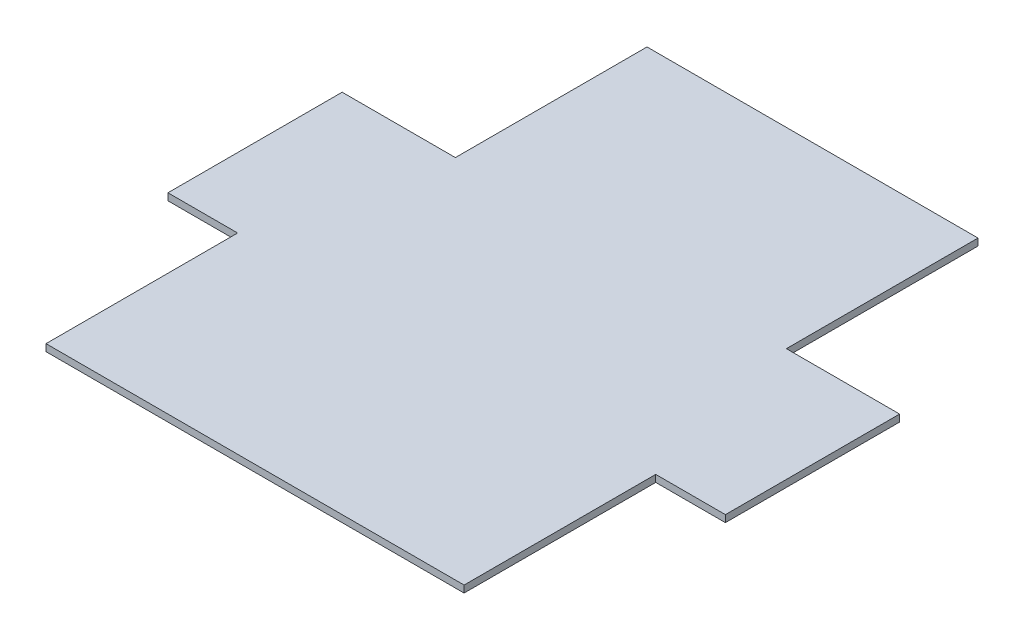
ISO-10303-21;
HEADER;
FILE_DESCRIPTION(('STEP AP214'),'2;1');
FILE_NAME('part.step','',(''),(''),'','','');
FILE_SCHEMA(('AUTOMOTIVE_DESIGN { 1 0 10303 214 1 1 1 1 }'));
ENDSEC;
DATA;
#1=APPLICATION_CONTEXT('core data for automotive mechanical design processes');
#2=APPLICATION_PROTOCOL_DEFINITION('international standard','automotive_design',2000,#1);
#3=PRODUCT_CONTEXT('',#1,'mechanical');
#4=PRODUCT('Part','Part','',(#3));
#5=PRODUCT_RELATED_PRODUCT_CATEGORY('part','',(#4));
#6=PRODUCT_DEFINITION_FORMATION('','',#4);
#7=PRODUCT_DEFINITION_CONTEXT('part definition',#1,'design');
#8=PRODUCT_DEFINITION('design','',#6,#7);
#9=PRODUCT_DEFINITION_SHAPE('','',#8);
#10=(LENGTH_UNIT() NAMED_UNIT(*) SI_UNIT(.MILLI.,.METRE.));
#11=(NAMED_UNIT(*) PLANE_ANGLE_UNIT() SI_UNIT($,.RADIAN.));
#12=(NAMED_UNIT(*) SI_UNIT($,.STERADIAN.) SOLID_ANGLE_UNIT());
#13=UNCERTAINTY_MEASURE_WITH_UNIT(LENGTH_MEASURE(1.E-05),#10,'distance_accuracy_value','');
#14=(GEOMETRIC_REPRESENTATION_CONTEXT(3) GLOBAL_UNCERTAINTY_ASSIGNED_CONTEXT((#13)) GLOBAL_UNIT_ASSIGNED_CONTEXT((#10,
#11,#12)) REPRESENTATION_CONTEXT('',''));
#15=CARTESIAN_POINT('',(0.,0.,0.));
#16=DIRECTION('',(0.,0.,1.));
#17=DIRECTION('',(1.,0.,0.));
#18=AXIS2_PLACEMENT_3D('',#15,#16,#17);
#19=CARTESIAN_POINT('',(-47.5,2.,-80.));
#20=DIRECTION('',(1.,0.,0.));
#21=DIRECTION('',(0.,0.,-1.));
#22=AXIS2_PLACEMENT_3D('',#19,#20,#21);
#23=PLANE('',#22);
#24=DIRECTION('',(0.,0.,1.));
#25=VECTOR('',#24,1.);
#26=CARTESIAN_POINT('',(-47.5,0.,-80.));
#27=LINE('',#26,#25);
#28=CARTESIAN_POINT('',(-47.5,0.,-80.));
#29=VERTEX_POINT('',#28);
#30=CARTESIAN_POINT('',(-47.5,0.,-25.));
#31=VERTEX_POINT('',#30);
#32=EDGE_CURVE('E152',#29,#31,#27,.T.);
#33=ORIENTED_EDGE('',*,*,#32,.T.);
#34=DIRECTION('',(0.,-1.,0.));
#35=VECTOR('',#34,1.);
#36=CARTESIAN_POINT('',(-47.5,2.,-25.));
#37=LINE('',#36,#35);
#38=CARTESIAN_POINT('',(-47.5,2.,-25.));
#39=VERTEX_POINT('',#38);
#40=EDGE_CURVE('E11',#39,#31,#37,.T.);
#41=ORIENTED_EDGE('',*,*,#40,.F.);
#42=DIRECTION('',(0.,0.,1.));
#43=VECTOR('',#42,1.);
#44=CARTESIAN_POINT('',(-47.5,2.,-80.));
#45=LINE('',#44,#43);
#46=CARTESIAN_POINT('',(-47.5,2.,-80.));
#47=VERTEX_POINT('',#46);
#48=EDGE_CURVE('E174',#47,#39,#45,.T.);
#49=ORIENTED_EDGE('',*,*,#48,.F.);
#50=DIRECTION('',(0.,-1.,0.));
#51=VECTOR('',#50,1.);
#52=CARTESIAN_POINT('',(-47.5,2.,-80.));
#53=LINE('',#52,#51);
#54=EDGE_CURVE('E148',#47,#29,#53,.T.);
#55=ORIENTED_EDGE('',*,*,#54,.T.);
#56=EDGE_LOOP('',(#33,#41,#49,#55));
#57=FACE_BOUND('',#56,.T.);
#58=ADVANCED_FACE('F32',(#57),#23,.F.);
#59=CARTESIAN_POINT('',(-80.,2.,-25.));
#60=DIRECTION('',(0.,0.,1.));
#61=DIRECTION('',(1.,0.,0.));
#62=AXIS2_PLACEMENT_3D('',#59,#60,#61);
#63=PLANE('',#62);
#64=DIRECTION('',(-1.,0.,0.));
#65=VECTOR('',#64,1.);
#66=CARTESIAN_POINT('',(-80.,0.,-25.));
#67=LINE('',#66,#65);
#68=CARTESIAN_POINT('',(-80.,0.,-25.));
#69=VERTEX_POINT('',#68);
#70=EDGE_CURVE('E155',#31,#69,#67,.T.);
#71=ORIENTED_EDGE('',*,*,#70,.T.);
#72=DIRECTION('',(0.,-1.,0.));
#73=VECTOR('',#72,1.);
#74=CARTESIAN_POINT('',(-80.,2.,-25.));
#75=LINE('',#74,#73);
#76=CARTESIAN_POINT('',(-80.,2.,-25.));
#77=VERTEX_POINT('',#76);
#78=EDGE_CURVE('E40',#77,#69,#75,.T.);
#79=ORIENTED_EDGE('',*,*,#78,.F.);
#80=DIRECTION('',(-1.,0.,0.));
#81=VECTOR('',#80,1.);
#82=CARTESIAN_POINT('',(-80.,2.,-25.));
#83=LINE('',#82,#81);
#84=EDGE_CURVE('E103',#39,#77,#83,.T.);
#85=ORIENTED_EDGE('',*,*,#84,.F.);
#86=ORIENTED_EDGE('',*,*,#40,.T.);
#87=EDGE_LOOP('',(#71,#79,#85,#86));
#88=FACE_BOUND('',#87,.T.);
#89=ADVANCED_FACE('F252',(#88),#63,.F.);
#90=CARTESIAN_POINT('',(-80.,2.,-25.));
#91=DIRECTION('',(1.,0.,0.));
#92=DIRECTION('',(0.,0.,-1.));
#93=AXIS2_PLACEMENT_3D('',#90,#91,#92);
#94=PLANE('',#93);
#95=DIRECTION('',(0.,0.,1.));
#96=VECTOR('',#95,1.);
#97=CARTESIAN_POINT('',(-80.,0.,-25.));
#98=LINE('',#97,#96);
#99=CARTESIAN_POINT('',(-80.,0.,25.));
#100=VERTEX_POINT('',#99);
#101=EDGE_CURVE('E157',#69,#100,#98,.T.);
#102=ORIENTED_EDGE('',*,*,#101,.T.);
#103=DIRECTION('',(0.,-1.,0.));
#104=VECTOR('',#103,1.);
#105=CARTESIAN_POINT('',(-80.,2.,25.));
#106=LINE('',#105,#104);
#107=CARTESIAN_POINT('',(-80.,2.,25.));
#108=VERTEX_POINT('',#107);
#109=EDGE_CURVE('E193',#108,#100,#106,.T.);
#110=ORIENTED_EDGE('',*,*,#109,.F.);
#111=DIRECTION('',(0.,0.,1.));
#112=VECTOR('',#111,1.);
#113=CARTESIAN_POINT('',(-80.,2.,-25.));
#114=LINE('',#113,#112);
#115=EDGE_CURVE('E201',#77,#108,#114,.T.);
#116=ORIENTED_EDGE('',*,*,#115,.F.);
#117=ORIENTED_EDGE('',*,*,#78,.T.);
#118=EDGE_LOOP('',(#102,#110,#116,#117));
#119=FACE_BOUND('',#118,.T.);
#120=ADVANCED_FACE('F199',(#119),#94,.F.);
#121=CARTESIAN_POINT('',(-80.,2.,25.));
#122=DIRECTION('',(0.,0.,-1.));
#123=DIRECTION('',(-1.,0.,0.));
#124=AXIS2_PLACEMENT_3D('',#121,#122,#123);
#125=PLANE('',#124);
#126=DIRECTION('',(1.,0.,0.));
#127=VECTOR('',#126,1.);
#128=CARTESIAN_POINT('',(-80.,0.,25.));
#129=LINE('',#128,#127);
#130=CARTESIAN_POINT('',(-60.,0.,25.));
#131=VERTEX_POINT('',#130);
#132=EDGE_CURVE('E159',#100,#131,#129,.T.);
#133=ORIENTED_EDGE('',*,*,#132,.T.);
#134=DIRECTION('',(0.,-1.,0.));
#135=VECTOR('',#134,1.);
#136=CARTESIAN_POINT('',(-60.,2.,25.));
#137=LINE('',#136,#135);
#138=CARTESIAN_POINT('',(-60.,2.,25.));
#139=VERTEX_POINT('',#138);
#140=EDGE_CURVE('E190',#139,#131,#137,.T.);
#141=ORIENTED_EDGE('',*,*,#140,.F.);
#142=DIRECTION('',(1.,0.,0.));
#143=VECTOR('',#142,1.);
#144=CARTESIAN_POINT('',(-80.,2.,25.));
#145=LINE('',#144,#143);
#146=EDGE_CURVE('E219',#108,#139,#145,.T.);
#147=ORIENTED_EDGE('',*,*,#146,.F.);
#148=ORIENTED_EDGE('',*,*,#109,.T.);
#149=EDGE_LOOP('',(#133,#141,#147,#148));
#150=FACE_BOUND('',#149,.T.);
#151=ADVANCED_FACE('F210',(#150),#125,.F.);
#152=CARTESIAN_POINT('',(-60.,2.,25.));
#153=DIRECTION('',(1.,0.,0.));
#154=DIRECTION('',(0.,0.,-1.));
#155=AXIS2_PLACEMENT_3D('',#152,#153,#154);
#156=PLANE('',#155);
#157=DIRECTION('',(0.,0.,1.));
#158=VECTOR('',#157,1.);
#159=CARTESIAN_POINT('',(-60.,0.,25.));
#160=LINE('',#159,#158);
#161=CARTESIAN_POINT('',(-60.,0.,80.));
#162=VERTEX_POINT('',#161);
#163=EDGE_CURVE('E161',#131,#162,#160,.T.);
#164=ORIENTED_EDGE('',*,*,#163,.T.);
#165=DIRECTION('',(0.,-1.,0.));
#166=VECTOR('',#165,1.);
#167=CARTESIAN_POINT('',(-60.,2.,80.));
#168=LINE('',#167,#166);
#169=CARTESIAN_POINT('',(-60.,2.,80.));
#170=VERTEX_POINT('',#169);
#171=EDGE_CURVE('E187',#170,#162,#168,.T.);
#172=ORIENTED_EDGE('',*,*,#171,.F.);
#173=DIRECTION('',(0.,0.,1.));
#174=VECTOR('',#173,1.);
#175=CARTESIAN_POINT('',(-60.,2.,25.));
#176=LINE('',#175,#174);
#177=EDGE_CURVE('E216',#139,#170,#176,.T.);
#178=ORIENTED_EDGE('',*,*,#177,.F.);
#179=ORIENTED_EDGE('',*,*,#140,.T.);
#180=EDGE_LOOP('',(#164,#172,#178,#179));
#181=FACE_BOUND('',#180,.T.);
#182=ADVANCED_FACE('F214',(#181),#156,.F.);
#183=CARTESIAN_POINT('',(-60.,2.,80.));
#184=DIRECTION('',(0.,0.,-1.));
#185=DIRECTION('',(-1.,0.,0.));
#186=AXIS2_PLACEMENT_3D('',#183,#184,#185);
#187=PLANE('',#186);
#188=DIRECTION('',(1.,0.,0.));
#189=VECTOR('',#188,1.);
#190=CARTESIAN_POINT('',(-60.,0.,80.));
#191=LINE('',#190,#189);
#192=CARTESIAN_POINT('',(60.,0.,80.));
#193=VERTEX_POINT('',#192);
#194=EDGE_CURVE('E163',#162,#193,#191,.T.);
#195=ORIENTED_EDGE('',*,*,#194,.T.);
#196=DIRECTION('',(0.,-1.,0.));
#197=VECTOR('',#196,1.);
#198=CARTESIAN_POINT('',(60.,2.,80.));
#199=LINE('',#198,#197);
#200=CARTESIAN_POINT('',(60.,2.,80.));
#201=VERTEX_POINT('',#200);
#202=EDGE_CURVE('E184',#201,#193,#199,.T.);
#203=ORIENTED_EDGE('',*,*,#202,.F.);
#204=DIRECTION('',(1.,0.,0.));
#205=VECTOR('',#204,1.);
#206=CARTESIAN_POINT('',(-60.,2.,80.));
#207=LINE('',#206,#205);
#208=EDGE_CURVE('E218',#170,#201,#207,.T.);
#209=ORIENTED_EDGE('',*,*,#208,.F.);
#210=ORIENTED_EDGE('',*,*,#171,.T.);
#211=EDGE_LOOP('',(#195,#203,#209,#210));
#212=FACE_BOUND('',#211,.T.);
#213=ADVANCED_FACE('F265',(#212),#187,.F.);
#214=CARTESIAN_POINT('',(60.,2.,25.));
#215=DIRECTION('',(-1.,0.,0.));
#216=DIRECTION('',(0.,0.,1.));
#217=AXIS2_PLACEMENT_3D('',#214,#215,#216);
#218=PLANE('',#217);
#219=DIRECTION('',(0.,0.,-1.));
#220=VECTOR('',#219,1.);
#221=CARTESIAN_POINT('',(60.,0.,25.));
#222=LINE('',#221,#220);
#223=CARTESIAN_POINT('',(60.,0.,25.));
#224=VERTEX_POINT('',#223);
#225=EDGE_CURVE('E165',#193,#224,#222,.T.);
#226=ORIENTED_EDGE('',*,*,#225,.T.);
#227=DIRECTION('',(0.,-1.,0.));
#228=VECTOR('',#227,1.);
#229=CARTESIAN_POINT('',(60.,2.,25.));
#230=LINE('',#229,#228);
#231=CARTESIAN_POINT('',(60.,2.,25.));
#232=VERTEX_POINT('',#231);
#233=EDGE_CURVE('E181',#232,#224,#230,.T.);
#234=ORIENTED_EDGE('',*,*,#233,.F.);
#235=DIRECTION('',(0.,0.,-1.));
#236=VECTOR('',#235,1.);
#237=CARTESIAN_POINT('',(60.,2.,25.));
#238=LINE('',#237,#236);
#239=EDGE_CURVE('E221',#201,#232,#238,.T.);
#240=ORIENTED_EDGE('',*,*,#239,.F.);
#241=ORIENTED_EDGE('',*,*,#202,.T.);
#242=EDGE_LOOP('',(#226,#234,#240,#241));
#243=FACE_BOUND('',#242,.T.);
#244=ADVANCED_FACE('F268',(#243),#218,.F.);
#245=CARTESIAN_POINT('',(60.,2.,25.));
#246=DIRECTION('',(0.,0.,-1.));
#247=DIRECTION('',(-1.,0.,0.));
#248=AXIS2_PLACEMENT_3D('',#245,#246,#247);
#249=PLANE('',#248);
#250=DIRECTION('',(1.,0.,0.));
#251=VECTOR('',#250,1.);
#252=CARTESIAN_POINT('',(60.,0.,25.));
#253=LINE('',#252,#251);
#254=CARTESIAN_POINT('',(80.,0.,25.));
#255=VERTEX_POINT('',#254);
#256=EDGE_CURVE('E167',#224,#255,#253,.T.);
#257=ORIENTED_EDGE('',*,*,#256,.T.);
#258=DIRECTION('',(0.,-1.,0.));
#259=VECTOR('',#258,1.);
#260=CARTESIAN_POINT('',(80.,2.,25.));
#261=LINE('',#260,#259);
#262=CARTESIAN_POINT('',(80.,2.,25.));
#263=VERTEX_POINT('',#262);
#264=EDGE_CURVE('E178',#263,#255,#261,.T.);
#265=ORIENTED_EDGE('',*,*,#264,.F.);
#266=DIRECTION('',(1.,0.,0.));
#267=VECTOR('',#266,1.);
#268=CARTESIAN_POINT('',(60.,2.,25.));
#269=LINE('',#268,#267);
#270=EDGE_CURVE('E227',#232,#263,#269,.T.);
#271=ORIENTED_EDGE('',*,*,#270,.F.);
#272=ORIENTED_EDGE('',*,*,#233,.T.);
#273=EDGE_LOOP('',(#257,#265,#271,#272));
#274=FACE_BOUND('',#273,.T.);
#275=ADVANCED_FACE('F233',(#274),#249,.F.);
#276=CARTESIAN_POINT('',(80.,2.,-25.));
#277=DIRECTION('',(-1.,0.,0.));
#278=DIRECTION('',(0.,0.,1.));
#279=AXIS2_PLACEMENT_3D('',#276,#277,#278);
#280=PLANE('',#279);
#281=DIRECTION('',(0.,0.,-1.));
#282=VECTOR('',#281,1.);
#283=CARTESIAN_POINT('',(80.,0.,-25.));
#284=LINE('',#283,#282);
#285=CARTESIAN_POINT('',(80.,0.,-25.));
#286=VERTEX_POINT('',#285);
#287=EDGE_CURVE('E169',#255,#286,#284,.T.);
#288=ORIENTED_EDGE('',*,*,#287,.T.);
#289=DIRECTION('',(0.,-1.,0.));
#290=VECTOR('',#289,1.);
#291=CARTESIAN_POINT('',(80.,2.,-25.));
#292=LINE('',#291,#290);
#293=CARTESIAN_POINT('',(80.,2.,-25.));
#294=VERTEX_POINT('',#293);
#295=EDGE_CURVE('E143',#294,#286,#292,.T.);
#296=ORIENTED_EDGE('',*,*,#295,.F.);
#297=DIRECTION('',(0.,0.,-1.));
#298=VECTOR('',#297,1.);
#299=CARTESIAN_POINT('',(80.,2.,-25.));
#300=LINE('',#299,#298);
#301=EDGE_CURVE('E134',#263,#294,#300,.T.);
#302=ORIENTED_EDGE('',*,*,#301,.F.);
#303=ORIENTED_EDGE('',*,*,#264,.T.);
#304=EDGE_LOOP('',(#288,#296,#302,#303));
#305=FACE_BOUND('',#304,.T.);
#306=ADVANCED_FACE('F237',(#305),#280,.F.);
#307=CARTESIAN_POINT('',(47.5,2.,-25.));
#308=DIRECTION('',(0.,0.,1.));
#309=DIRECTION('',(1.,0.,0.));
#310=AXIS2_PLACEMENT_3D('',#307,#308,#309);
#311=PLANE('',#310);
#312=DIRECTION('',(-1.,0.,0.));
#313=VECTOR('',#312,1.);
#314=CARTESIAN_POINT('',(47.5,0.,-25.));
#315=LINE('',#314,#313);
#316=CARTESIAN_POINT('',(47.5,0.,-25.));
#317=VERTEX_POINT('',#316);
#318=EDGE_CURVE('E142',#286,#317,#315,.T.);
#319=ORIENTED_EDGE('',*,*,#318,.T.);
#320=DIRECTION('',(0.,-1.,0.));
#321=VECTOR('',#320,1.);
#322=CARTESIAN_POINT('',(47.5,2.,-25.));
#323=LINE('',#322,#321);
#324=CARTESIAN_POINT('',(47.5,2.,-25.));
#325=VERTEX_POINT('',#324);
#326=EDGE_CURVE('E139',#325,#317,#323,.T.);
#327=ORIENTED_EDGE('',*,*,#326,.F.);
#328=DIRECTION('',(-1.,0.,0.));
#329=VECTOR('',#328,1.);
#330=CARTESIAN_POINT('',(47.5,2.,-25.));
#331=LINE('',#330,#329);
#332=EDGE_CURVE('E128',#294,#325,#331,.T.);
#333=ORIENTED_EDGE('',*,*,#332,.F.);
#334=ORIENTED_EDGE('',*,*,#295,.T.);
#335=EDGE_LOOP('',(#319,#327,#333,#334));
#336=FACE_BOUND('',#335,.T.);
#337=ADVANCED_FACE('F140',(#336),#311,.F.);
#338=CARTESIAN_POINT('',(47.5,2.,-80.));
#339=DIRECTION('',(-1.,0.,0.));
#340=DIRECTION('',(0.,0.,1.));
#341=AXIS2_PLACEMENT_3D('',#338,#339,#340);
#342=PLANE('',#341);
#343=DIRECTION('',(0.,0.,-1.));
#344=VECTOR('',#343,1.);
#345=CARTESIAN_POINT('',(47.5,0.,-80.));
#346=LINE('',#345,#344);
#347=CARTESIAN_POINT('',(47.5,0.,-80.));
#348=VERTEX_POINT('',#347);
#349=EDGE_CURVE('E89',#317,#348,#346,.T.);
#350=ORIENTED_EDGE('',*,*,#349,.T.);
#351=DIRECTION('',(0.,-1.,0.));
#352=VECTOR('',#351,1.);
#353=CARTESIAN_POINT('',(47.5,2.,-80.));
#354=LINE('',#353,#352);
#355=CARTESIAN_POINT('',(47.5,2.,-80.));
#356=VERTEX_POINT('',#355);
#357=EDGE_CURVE('E144',#356,#348,#354,.T.);
#358=ORIENTED_EDGE('',*,*,#357,.F.);
#359=DIRECTION('',(0.,0.,-1.));
#360=VECTOR('',#359,1.);
#361=CARTESIAN_POINT('',(47.5,2.,-80.));
#362=LINE('',#361,#360);
#363=EDGE_CURVE('E132',#325,#356,#362,.T.);
#364=ORIENTED_EDGE('',*,*,#363,.F.);
#365=ORIENTED_EDGE('',*,*,#326,.T.);
#366=EDGE_LOOP('',(#350,#358,#364,#365));
#367=FACE_BOUND('',#366,.T.);
#368=ADVANCED_FACE('F146',(#367),#342,.F.);
#369=CARTESIAN_POINT('',(-47.5,2.,-80.));
#370=DIRECTION('',(0.,0.,1.));
#371=DIRECTION('',(1.,0.,0.));
#372=AXIS2_PLACEMENT_3D('',#369,#370,#371);
#373=PLANE('',#372);
#374=DIRECTION('',(-1.,0.,0.));
#375=VECTOR('',#374,1.);
#376=CARTESIAN_POINT('',(-47.5,0.,-80.));
#377=LINE('',#376,#375);
#378=EDGE_CURVE('E95',#348,#29,#377,.T.);
#379=ORIENTED_EDGE('',*,*,#378,.T.);
#380=ORIENTED_EDGE('',*,*,#54,.F.);
#381=DIRECTION('',(-1.,0.,0.));
#382=VECTOR('',#381,1.);
#383=CARTESIAN_POINT('',(-47.5,2.,-80.));
#384=LINE('',#383,#382);
#385=EDGE_CURVE('E48',#356,#47,#384,.T.);
#386=ORIENTED_EDGE('',*,*,#385,.F.);
#387=ORIENTED_EDGE('',*,*,#357,.T.);
#388=EDGE_LOOP('',(#379,#380,#386,#387));
#389=FACE_BOUND('',#388,.T.);
#390=ADVANCED_FACE('F241',(#389),#373,.F.);
#391=CARTESIAN_POINT('',(-47.5,2.,-25.));
#392=DIRECTION('',(0.,1.,0.));
#393=DIRECTION('',(0.,0.,1.));
#394=AXIS2_PLACEMENT_3D('',#391,#392,#393);
#395=PLANE('',#394);
#396=ORIENTED_EDGE('',*,*,#48,.T.);
#397=ORIENTED_EDGE('',*,*,#84,.T.);
#398=ORIENTED_EDGE('',*,*,#115,.T.);
#399=ORIENTED_EDGE('',*,*,#146,.T.);
#400=ORIENTED_EDGE('',*,*,#177,.T.);
#401=ORIENTED_EDGE('',*,*,#208,.T.);
#402=ORIENTED_EDGE('',*,*,#239,.T.);
#403=ORIENTED_EDGE('',*,*,#270,.T.);
#404=ORIENTED_EDGE('',*,*,#301,.T.);
#405=ORIENTED_EDGE('',*,*,#332,.T.);
#406=ORIENTED_EDGE('',*,*,#363,.T.);
#407=ORIENTED_EDGE('',*,*,#385,.T.);
#408=EDGE_LOOP('',(#396,#397,#398,#399,#400,#401,#402,#403,#404,#405,#406,#407));
#409=FACE_BOUND('',#408,.T.);
#410=ADVANCED_FACE('F130',(#409),#395,.T.);
#411=CARTESIAN_POINT('',(-47.5,0.,-25.));
#412=DIRECTION('',(0.,1.,0.));
#413=DIRECTION('',(0.,0.,1.));
#414=AXIS2_PLACEMENT_3D('',#411,#412,#413);
#415=PLANE('',#414);
#416=ORIENTED_EDGE('',*,*,#32,.F.);
#417=ORIENTED_EDGE('',*,*,#378,.F.);
#418=ORIENTED_EDGE('',*,*,#349,.F.);
#419=ORIENTED_EDGE('',*,*,#318,.F.);
#420=ORIENTED_EDGE('',*,*,#287,.F.);
#421=ORIENTED_EDGE('',*,*,#256,.F.);
#422=ORIENTED_EDGE('',*,*,#225,.F.);
#423=ORIENTED_EDGE('',*,*,#194,.F.);
#424=ORIENTED_EDGE('',*,*,#163,.F.);
#425=ORIENTED_EDGE('',*,*,#132,.F.);
#426=ORIENTED_EDGE('',*,*,#101,.F.);
#427=ORIENTED_EDGE('',*,*,#70,.F.);
#428=EDGE_LOOP('',(#416,#417,#418,#419,#420,#421,#422,#423,#424,#425,#426,#427));
#429=FACE_BOUND('',#428,.T.);
#430=ADVANCED_FACE('F205',(#429),#415,.F.);
#431=CLOSED_SHELL('',(#58,#89,#120,#151,#182,#213,#244,#275,#306,#337,#368,#390,#410,#430));
#432=MANIFOLD_SOLID_BREP('B2',#431);
#433=ADVANCED_BREP_SHAPE_REPRESENTATION('',(#18,#432),#14);
#434=SHAPE_DEFINITION_REPRESENTATION(#9,#433);
ENDSEC;
END-ISO-10303-21;
